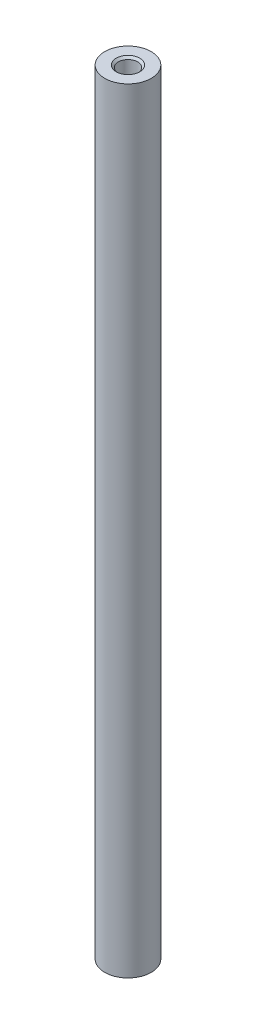
ISO-10303-21;
HEADER;
FILE_DESCRIPTION(('STEP AP214'),'2;1');
FILE_NAME('part.step','',(''),(''),'','','');
FILE_SCHEMA(('AUTOMOTIVE_DESIGN { 1 0 10303 214 1 1 1 1 }'));
ENDSEC;
DATA;
#1=APPLICATION_CONTEXT('core data for automotive mechanical design processes');
#2=APPLICATION_PROTOCOL_DEFINITION('international standard','automotive_design',2000,#1);
#3=PRODUCT_CONTEXT('',#1,'mechanical');
#4=PRODUCT('Part','Part','',(#3));
#5=PRODUCT_RELATED_PRODUCT_CATEGORY('part','',(#4));
#6=PRODUCT_DEFINITION_FORMATION('','',#4);
#7=PRODUCT_DEFINITION_CONTEXT('part definition',#1,'design');
#8=PRODUCT_DEFINITION('design','',#6,#7);
#9=PRODUCT_DEFINITION_SHAPE('','',#8);
#10=(LENGTH_UNIT() NAMED_UNIT(*) SI_UNIT(.MILLI.,.METRE.));
#11=(NAMED_UNIT(*) PLANE_ANGLE_UNIT() SI_UNIT($,.RADIAN.));
#12=(NAMED_UNIT(*) SI_UNIT($,.STERADIAN.) SOLID_ANGLE_UNIT());
#13=UNCERTAINTY_MEASURE_WITH_UNIT(LENGTH_MEASURE(1.E-05),#10,'distance_accuracy_value','');
#14=(GEOMETRIC_REPRESENTATION_CONTEXT(3) GLOBAL_UNCERTAINTY_ASSIGNED_CONTEXT((#13)) GLOBAL_UNIT_ASSIGNED_CONTEXT((#10,
#11,#12)) REPRESENTATION_CONTEXT('',''));
#15=CARTESIAN_POINT('',(0.,0.,0.));
#16=DIRECTION('',(0.,0.,1.));
#17=DIRECTION('',(1.,0.,0.));
#18=AXIS2_PLACEMENT_3D('',#15,#16,#17);
#19=CARTESIAN_POINT('',(0.,100.,0.));
#20=DIRECTION('',(0.,-1.,0.));
#21=DIRECTION('',(0.,0.,-1.));
#22=AXIS2_PLACEMENT_3D('',#19,#20,#21);
#23=CYLINDRICAL_SURFACE('',#22,3.);
#24=CARTESIAN_POINT('',(0.,100.,0.));
#25=DIRECTION('',(0.,1.,0.));
#26=DIRECTION('',(0.,0.,1.));
#27=AXIS2_PLACEMENT_3D('',#24,#25,#26);
#28=CIRCLE('',#27,3.);
#29=CARTESIAN_POINT('',(0.,100.,3.));
#30=VERTEX_POINT('',#29);
#31=EDGE_CURVE('E11',#30,#30,#28,.T.);
#32=ORIENTED_EDGE('',*,*,#31,.F.);
#33=EDGE_LOOP('',(#32));
#34=FACE_BOUND('',#33,.T.);
#35=CARTESIAN_POINT('',(0.,0.,0.));
#36=DIRECTION('',(0.,1.,0.));
#37=DIRECTION('',(0.,0.,1.));
#38=AXIS2_PLACEMENT_3D('',#35,#36,#37);
#39=CIRCLE('',#38,3.);
#40=CARTESIAN_POINT('',(0.,0.,3.));
#41=VERTEX_POINT('',#40);
#42=EDGE_CURVE('E40',#41,#41,#39,.T.);
#43=ORIENTED_EDGE('',*,*,#42,.T.);
#44=EDGE_LOOP('',(#43));
#45=FACE_BOUND('',#44,.T.);
#46=ADVANCED_FACE('F37',(#34,#45),#23,.T.);
#47=CARTESIAN_POINT('',(0.,100.,0.));
#48=DIRECTION('',(0.,1.,0.));
#49=DIRECTION('',(0.,0.,1.));
#50=AXIS2_PLACEMENT_3D('',#47,#48,#49);
#51=PLANE('',#50);
#52=CARTESIAN_POINT('',(0.,100.,0.));
#53=DIRECTION('',(0.,1.,0.));
#54=DIRECTION('',(0.,0.,1.));
#55=AXIS2_PLACEMENT_3D('',#52,#53,#54);
#56=CIRCLE('',#55,1.525);
#57=CARTESIAN_POINT('',(0.,100.,1.525));
#58=VERTEX_POINT('',#57);
#59=EDGE_CURVE('E67',#58,#58,#56,.T.);
#60=ORIENTED_EDGE('',*,*,#59,.F.);
#61=EDGE_LOOP('',(#60));
#62=FACE_BOUND('',#61,.T.);
#63=ORIENTED_EDGE('',*,*,#31,.T.);
#64=EDGE_LOOP('',(#63));
#65=FACE_BOUND('',#64,.T.);
#66=ADVANCED_FACE('F84',(#62,#65),#51,.T.);
#67=CARTESIAN_POINT('',(0.,0.,0.));
#68=DIRECTION('',(0.,1.,0.));
#69=DIRECTION('',(0.,0.,1.));
#70=AXIS2_PLACEMENT_3D('',#67,#68,#69);
#71=PLANE('',#70);
#72=CARTESIAN_POINT('',(0.,-1.25767452008319E-13,0.));
#73=DIRECTION('',(0.,-1.,0.));
#74=DIRECTION('',(0.,0.,-1.));
#75=AXIS2_PLACEMENT_3D('',#72,#73,#74);
#76=CIRCLE('',#75,1.525);
#77=CARTESIAN_POINT('',(0.,-1.25767452008319E-13,-1.525));
#78=VERTEX_POINT('',#77);
#79=EDGE_CURVE('E60',#78,#78,#76,.T.);
#80=ORIENTED_EDGE('',*,*,#79,.F.);
#81=EDGE_LOOP('',(#80));
#82=FACE_BOUND('',#81,.T.);
#83=ORIENTED_EDGE('',*,*,#42,.F.);
#84=EDGE_LOOP('',(#83));
#85=FACE_BOUND('',#84,.T.);
#86=ADVANCED_FACE('F81',(#82,#85),#71,.F.);
#87=CARTESIAN_POINT('',(0.,5.,0.));
#88=DIRECTION('',(0.,-1.,0.));
#89=DIRECTION('',(0.,0.,-1.));
#90=AXIS2_PLACEMENT_3D('',#87,#88,#89);
#91=CONICAL_SURFACE('',#90,1.25,1.02974425867665);
#92=CARTESIAN_POINT('',(0.,5.75107577378445,0.));
#93=VERTEX_POINT('',#92);
#94=VERTEX_LOOP('',#93);
#95=FACE_BOUND('',#94,.T.);
#96=CARTESIAN_POINT('',(0.,5.,0.));
#97=DIRECTION('',(0.,-1.,0.));
#98=DIRECTION('',(0.,0.,-1.));
#99=AXIS2_PLACEMENT_3D('',#96,#97,#98);
#100=CIRCLE('',#99,1.25);
#101=CARTESIAN_POINT('',(0.,5.,-1.25));
#102=VERTEX_POINT('',#101);
#103=EDGE_CURVE('E73',#102,#102,#100,.T.);
#104=ORIENTED_EDGE('',*,*,#103,.T.);
#105=EDGE_LOOP('',(#104));
#106=FACE_BOUND('',#105,.T.);
#107=ADVANCED_FACE('F83',(#95,#106),#91,.F.);
#108=CARTESIAN_POINT('',(0.,0.,0.));
#109=DIRECTION('',(0.,-1.,0.));
#110=DIRECTION('',(0.,0.,-1.));
#111=AXIS2_PLACEMENT_3D('',#108,#109,#110);
#112=CYLINDRICAL_SURFACE('',#111,1.25);
#113=ORIENTED_EDGE('',*,*,#103,.F.);
#114=EDGE_LOOP('',(#113));
#115=FACE_BOUND('',#114,.T.);
#116=CARTESIAN_POINT('',(0.,0.275000000000002,0.));
#117=DIRECTION('',(0.,-1.,0.));
#118=DIRECTION('',(0.,0.,-1.));
#119=AXIS2_PLACEMENT_3D('',#116,#117,#118);
#120=CIRCLE('',#119,1.25);
#121=CARTESIAN_POINT('',(0.,0.275000000000002,-1.25));
#122=VERTEX_POINT('',#121);
#123=EDGE_CURVE('E64',#122,#122,#120,.T.);
#124=ORIENTED_EDGE('',*,*,#123,.T.);
#125=EDGE_LOOP('',(#124));
#126=FACE_BOUND('',#125,.T.);
#127=ADVANCED_FACE('F90',(#115,#126),#112,.F.);
#128=CARTESIAN_POINT('',(0.,-1.25767452008319E-13,0.));
#129=DIRECTION('',(0.,-1.,0.));
#130=DIRECTION('',(0.,0.,-1.));
#131=AXIS2_PLACEMENT_3D('',#128,#129,#130);
#132=CONICAL_SURFACE('',#131,1.525,0.785398163397215);
#133=ORIENTED_EDGE('',*,*,#123,.F.);
#134=EDGE_LOOP('',(#133));
#135=FACE_BOUND('',#134,.T.);
#136=ORIENTED_EDGE('',*,*,#79,.T.);
#137=EDGE_LOOP('',(#136));
#138=FACE_BOUND('',#137,.T.);
#139=ADVANCED_FACE('F54',(#135,#138),#132,.F.);
#140=CARTESIAN_POINT('',(0.,95.,0.));
#141=DIRECTION('',(0.,1.,0.));
#142=DIRECTION('',(0.,0.,1.));
#143=AXIS2_PLACEMENT_3D('',#140,#141,#142);
#144=CONICAL_SURFACE('',#143,1.25,1.02974425867666);
#145=CARTESIAN_POINT('',(0.,94.2489242262156,0.));
#146=VERTEX_POINT('',#145);
#147=VERTEX_LOOP('',#146);
#148=FACE_BOUND('',#147,.T.);
#149=CARTESIAN_POINT('',(0.,95.,0.));
#150=DIRECTION('',(0.,1.,0.));
#151=DIRECTION('',(0.,0.,1.));
#152=AXIS2_PLACEMENT_3D('',#149,#150,#151);
#153=CIRCLE('',#152,1.25);
#154=CARTESIAN_POINT('',(0.,95.,1.25));
#155=VERTEX_POINT('',#154);
#156=EDGE_CURVE('E58',#155,#155,#153,.T.);
#157=ORIENTED_EDGE('',*,*,#156,.T.);
#158=EDGE_LOOP('',(#157));
#159=FACE_BOUND('',#158,.T.);
#160=ADVANCED_FACE('F50',(#148,#159),#144,.F.);
#161=CARTESIAN_POINT('',(0.,100.,0.));
#162=DIRECTION('',(0.,1.,0.));
#163=DIRECTION('',(0.,0.,1.));
#164=AXIS2_PLACEMENT_3D('',#161,#162,#163);
#165=CYLINDRICAL_SURFACE('',#164,1.25);
#166=ORIENTED_EDGE('',*,*,#156,.F.);
#167=EDGE_LOOP('',(#166));
#168=FACE_BOUND('',#167,.T.);
#169=CARTESIAN_POINT('',(0.,99.725,0.));
#170=DIRECTION('',(0.,1.,0.));
#171=DIRECTION('',(0.,0.,1.));
#172=AXIS2_PLACEMENT_3D('',#169,#170,#171);
#173=CIRCLE('',#172,1.25);
#174=CARTESIAN_POINT('',(0.,99.725,1.25));
#175=VERTEX_POINT('',#174);
#176=EDGE_CURVE('E61',#175,#175,#173,.T.);
#177=ORIENTED_EDGE('',*,*,#176,.T.);
#178=EDGE_LOOP('',(#177));
#179=FACE_BOUND('',#178,.T.);
#180=ADVANCED_FACE('F53',(#168,#179),#165,.F.);
#181=CARTESIAN_POINT('',(0.,100.,0.));
#182=DIRECTION('',(0.,1.,0.));
#183=DIRECTION('',(0.,0.,1.));
#184=AXIS2_PLACEMENT_3D('',#181,#182,#183);
#185=CONICAL_SURFACE('',#184,1.525,0.785398163397225);
#186=ORIENTED_EDGE('',*,*,#176,.F.);
#187=EDGE_LOOP('',(#186));
#188=FACE_BOUND('',#187,.T.);
#189=ORIENTED_EDGE('',*,*,#59,.T.);
#190=EDGE_LOOP('',(#189));
#191=FACE_BOUND('',#190,.T.);
#192=ADVANCED_FACE('F127',(#188,#191),#185,.F.);
#193=CLOSED_SHELL('',(#46,#66,#86,#107,#127,#139,#160,#180,#192));
#194=MANIFOLD_SOLID_BREP('B2',#193);
#195=ADVANCED_BREP_SHAPE_REPRESENTATION('',(#18,#194),#14);
#196=SHAPE_DEFINITION_REPRESENTATION(#9,#195);
ENDSEC;
END-ISO-10303-21;
